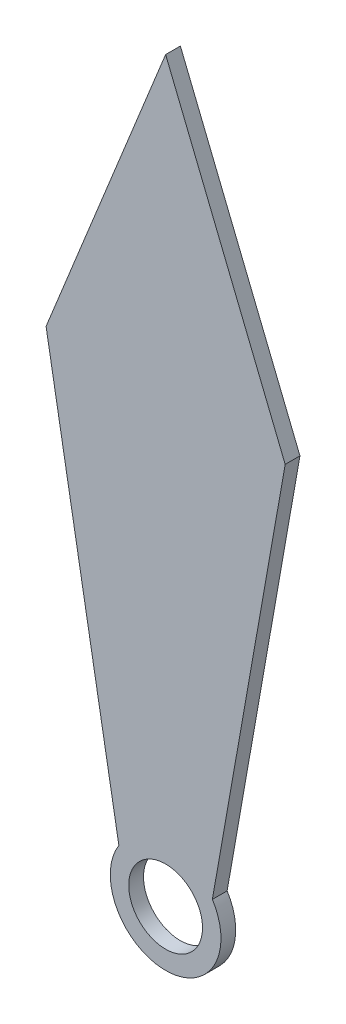
ISO-10303-21;
HEADER;
FILE_DESCRIPTION(('STEP AP214'),'2;1');
FILE_NAME('part.step','',(''),(''),'','','');
FILE_SCHEMA(('AUTOMOTIVE_DESIGN { 1 0 10303 214 1 1 1 1 }'));
ENDSEC;
DATA;
#1=APPLICATION_CONTEXT('core data for automotive mechanical design processes');
#2=APPLICATION_PROTOCOL_DEFINITION('international standard','automotive_design',2000,#1);
#3=PRODUCT_CONTEXT('',#1,'mechanical');
#4=PRODUCT('Part','Part','',(#3));
#5=PRODUCT_RELATED_PRODUCT_CATEGORY('part','',(#4));
#6=PRODUCT_DEFINITION_FORMATION('','',#4);
#7=PRODUCT_DEFINITION_CONTEXT('part definition',#1,'design');
#8=PRODUCT_DEFINITION('design','',#6,#7);
#9=PRODUCT_DEFINITION_SHAPE('','',#8);
#10=(LENGTH_UNIT() NAMED_UNIT(*) SI_UNIT(.MILLI.,.METRE.));
#11=(NAMED_UNIT(*) PLANE_ANGLE_UNIT() SI_UNIT($,.RADIAN.));
#12=(NAMED_UNIT(*) SI_UNIT($,.STERADIAN.) SOLID_ANGLE_UNIT());
#13=UNCERTAINTY_MEASURE_WITH_UNIT(LENGTH_MEASURE(1.E-05),#10,'distance_accuracy_value','');
#14=(GEOMETRIC_REPRESENTATION_CONTEXT(3) GLOBAL_UNCERTAINTY_ASSIGNED_CONTEXT((#13)) GLOBAL_UNIT_ASSIGNED_CONTEXT((#10,
#11,#12)) REPRESENTATION_CONTEXT('',''));
#15=CARTESIAN_POINT('',(0.,0.,0.));
#16=DIRECTION('',(0.,0.,1.));
#17=DIRECTION('',(1.,0.,0.));
#18=AXIS2_PLACEMENT_3D('',#15,#16,#17);
#19=CARTESIAN_POINT('',(-0.545954378426876,-0.0962028419331165,0.2));
#20=DIRECTION('',(-0.984827379924348,-0.17353683110897,0.));
#21=DIRECTION('',(0.17353683110897,-0.984827379924348,0.));
#22=AXIS2_PLACEMENT_3D('',#19,#20,#21);
#23=PLANE('',#22);
#24=DIRECTION('',(-0.17353683110897,0.984827379924349,0.));
#25=VECTOR('',#24,1.);
#26=CARTESIAN_POINT('',(-0.545954378426876,-0.0962028419331165,0.));
#27=LINE('',#26,#25);
#28=CARTESIAN_POINT('',(-0.633616904993946,0.401284958235283,0.));
#29=VERTEX_POINT('',#28);
#30=CARTESIAN_POINT('',(-1.62016874792159,6.,0.));
#31=VERTEX_POINT('',#30);
#32=EDGE_CURVE('E112',#29,#31,#27,.T.);
#33=ORIENTED_EDGE('',*,*,#32,.F.);
#34=DIRECTION('',(0.,0.,-1.));
#35=VECTOR('',#34,1.);
#36=CARTESIAN_POINT('',(-0.633616904993946,0.401284958235283,0.2));
#37=LINE('',#36,#35);
#38=CARTESIAN_POINT('',(-0.633616904993946,0.401284958235283,0.2));
#39=VERTEX_POINT('',#38);
#40=EDGE_CURVE('E11',#39,#29,#37,.T.);
#41=ORIENTED_EDGE('',*,*,#40,.F.);
#42=DIRECTION('',(-0.17353683110897,0.984827379924349,0.));
#43=VECTOR('',#42,1.);
#44=CARTESIAN_POINT('',(-0.545954378426876,-0.0962028419331165,0.2));
#45=LINE('',#44,#43);
#46=CARTESIAN_POINT('',(-1.62016874792159,6.,0.2));
#47=VERTEX_POINT('',#46);
#48=EDGE_CURVE('E125',#39,#47,#45,.T.);
#49=ORIENTED_EDGE('',*,*,#48,.T.);
#50=DIRECTION('',(0.,0.,-1.));
#51=VECTOR('',#50,1.);
#52=CARTESIAN_POINT('',(-1.62016874792159,6.,0.2));
#53=LINE('',#52,#51);
#54=EDGE_CURVE('E50',#47,#31,#53,.T.);
#55=ORIENTED_EDGE('',*,*,#54,.T.);
#56=EDGE_LOOP('',(#33,#41,#49,#55));
#57=FACE_BOUND('',#56,.T.);
#58=ADVANCED_FACE('F34',(#57),#23,.T.);
#59=CARTESIAN_POINT('',(0.,0.,0.2));
#60=DIRECTION('',(0.,0.,-1.));
#61=DIRECTION('',(-1.,0.,0.));
#62=AXIS2_PLACEMENT_3D('',#59,#60,#61);
#63=CYLINDRICAL_SURFACE('',#62,0.75);
#64=CARTESIAN_POINT('',(0.,0.,0.));
#65=DIRECTION('',(0.,0.,1.));
#66=DIRECTION('',(1.,0.,0.));
#67=AXIS2_PLACEMENT_3D('',#64,#65,#66);
#68=CIRCLE('',#67,0.75);
#69=CARTESIAN_POINT('',(0.633616904993946,0.401284958235283,0.));
#70=VERTEX_POINT('',#69);
#71=EDGE_CURVE('E114',#29,#70,#68,.T.);
#72=ORIENTED_EDGE('',*,*,#71,.T.);
#73=DIRECTION('',(0.,0.,-1.));
#74=VECTOR('',#73,1.);
#75=CARTESIAN_POINT('',(0.633616904993946,0.401284958235283,0.2));
#76=LINE('',#75,#74);
#77=CARTESIAN_POINT('',(0.633616904993946,0.401284958235283,0.2));
#78=VERTEX_POINT('',#77);
#79=EDGE_CURVE('E42',#78,#70,#76,.T.);
#80=ORIENTED_EDGE('',*,*,#79,.F.);
#81=CARTESIAN_POINT('',(0.,0.,0.2));
#82=DIRECTION('',(0.,0.,1.));
#83=DIRECTION('',(1.,0.,0.));
#84=AXIS2_PLACEMENT_3D('',#81,#82,#83);
#85=CIRCLE('',#84,0.75);
#86=EDGE_CURVE('E90',#39,#78,#85,.T.);
#87=ORIENTED_EDGE('',*,*,#86,.F.);
#88=ORIENTED_EDGE('',*,*,#40,.T.);
#89=EDGE_LOOP('',(#72,#80,#87,#88));
#90=FACE_BOUND('',#89,.T.);
#91=ADVANCED_FACE('F144',(#90),#63,.T.);
#92=CARTESIAN_POINT('',(0.545954378426876,-0.0962028419331165,0.2));
#93=DIRECTION('',(-0.984827379924348,0.17353683110897,0.));
#94=DIRECTION('',(-0.17353683110897,-0.984827379924348,0.));
#95=AXIS2_PLACEMENT_3D('',#92,#93,#94);
#96=PLANE('',#95);
#97=DIRECTION('',(0.17353683110897,0.984827379924349,0.));
#98=VECTOR('',#97,1.);
#99=CARTESIAN_POINT('',(0.545954378426876,-0.0962028419331165,0.));
#100=LINE('',#99,#98);
#101=CARTESIAN_POINT('',(1.62016874792159,6.,0.));
#102=VERTEX_POINT('',#101);
#103=EDGE_CURVE('E99',#70,#102,#100,.T.);
#104=ORIENTED_EDGE('',*,*,#103,.T.);
#105=DIRECTION('',(0.,0.,-1.));
#106=VECTOR('',#105,1.);
#107=CARTESIAN_POINT('',(1.62016874792159,6.,0.2));
#108=LINE('',#107,#106);
#109=CARTESIAN_POINT('',(1.62016874792159,6.,0.2));
#110=VERTEX_POINT('',#109);
#111=EDGE_CURVE('E96',#110,#102,#108,.T.);
#112=ORIENTED_EDGE('',*,*,#111,.F.);
#113=DIRECTION('',(0.17353683110897,0.984827379924349,0.));
#114=VECTOR('',#113,1.);
#115=CARTESIAN_POINT('',(0.545954378426876,-0.0962028419331165,0.2));
#116=LINE('',#115,#114);
#117=EDGE_CURVE('E82',#78,#110,#116,.T.);
#118=ORIENTED_EDGE('',*,*,#117,.F.);
#119=ORIENTED_EDGE('',*,*,#79,.T.);
#120=EDGE_LOOP('',(#104,#112,#118,#119));
#121=FACE_BOUND('',#120,.T.);
#122=ADVANCED_FACE('F97',(#121),#96,.F.);
#123=CARTESIAN_POINT('',(3.47956698674651,1.4093714220566,0.2));
#124=DIRECTION('',(-0.926856438610824,-0.375415958911792,0.));
#125=DIRECTION('',(0.375415958911792,-0.926856438610824,0.));
#126=AXIS2_PLACEMENT_3D('',#123,#124,#125);
#127=PLANE('',#126);
#128=DIRECTION('',(-0.375415958911792,0.926856438610824,0.));
#129=VECTOR('',#128,1.);
#130=CARTESIAN_POINT('',(3.47956698674651,1.4093714220566,0.));
#131=LINE('',#130,#129);
#132=CARTESIAN_POINT('',(0.,10.,0.));
#133=VERTEX_POINT('',#132);
#134=EDGE_CURVE('E117',#102,#133,#131,.T.);
#135=ORIENTED_EDGE('',*,*,#134,.T.);
#136=DIRECTION('',(0.,0.,-1.));
#137=VECTOR('',#136,1.);
#138=CARTESIAN_POINT('',(0.,10.,0.2));
#139=LINE('',#138,#137);
#140=CARTESIAN_POINT('',(0.,10.,0.2));
#141=VERTEX_POINT('',#140);
#142=EDGE_CURVE('E67',#141,#133,#139,.T.);
#143=ORIENTED_EDGE('',*,*,#142,.F.);
#144=DIRECTION('',(-0.375415958911792,0.926856438610824,0.));
#145=VECTOR('',#144,1.);
#146=CARTESIAN_POINT('',(3.47956698674651,1.4093714220566,0.2));
#147=LINE('',#146,#145);
#148=EDGE_CURVE('E89',#110,#141,#147,.T.);
#149=ORIENTED_EDGE('',*,*,#148,.F.);
#150=ORIENTED_EDGE('',*,*,#111,.T.);
#151=EDGE_LOOP('',(#135,#143,#149,#150));
#152=FACE_BOUND('',#151,.T.);
#153=ADVANCED_FACE('F103',(#152),#127,.F.);
#154=CARTESIAN_POINT('',(-3.47956698674651,1.4093714220566,0.2));
#155=DIRECTION('',(-0.926856438610824,0.375415958911792,0.));
#156=DIRECTION('',(-0.375415958911792,-0.926856438610824,0.));
#157=AXIS2_PLACEMENT_3D('',#154,#155,#156);
#158=PLANE('',#157);
#159=DIRECTION('',(0.375415958911792,0.926856438610824,0.));
#160=VECTOR('',#159,1.);
#161=CARTESIAN_POINT('',(-3.47956698674651,1.4093714220566,0.));
#162=LINE('',#161,#160);
#163=EDGE_CURVE('E119',#31,#133,#162,.T.);
#164=ORIENTED_EDGE('',*,*,#163,.F.);
#165=ORIENTED_EDGE('',*,*,#54,.F.);
#166=DIRECTION('',(0.375415958911792,0.926856438610824,0.));
#167=VECTOR('',#166,1.);
#168=CARTESIAN_POINT('',(-3.47956698674651,1.4093714220566,0.2));
#169=LINE('',#168,#167);
#170=EDGE_CURVE('E104',#47,#141,#169,.T.);
#171=ORIENTED_EDGE('',*,*,#170,.T.);
#172=ORIENTED_EDGE('',*,*,#142,.T.);
#173=EDGE_LOOP('',(#164,#165,#171,#172));
#174=FACE_BOUND('',#173,.T.);
#175=ADVANCED_FACE('F132',(#174),#158,.T.);
#176=CARTESIAN_POINT('',(0.,0.,0.2));
#177=DIRECTION('',(0.,0.,-1.));
#178=DIRECTION('',(-1.,0.,0.));
#179=AXIS2_PLACEMENT_3D('',#176,#177,#178);
#180=CYLINDRICAL_SURFACE('',#179,0.5);
#181=CARTESIAN_POINT('',(0.,0.,0.2));
#182=DIRECTION('',(0.,0.,1.));
#183=DIRECTION('',(1.,0.,0.));
#184=AXIS2_PLACEMENT_3D('',#181,#182,#183);
#185=CIRCLE('',#184,0.5);
#186=CARTESIAN_POINT('',(0.5,0.,0.2));
#187=VERTEX_POINT('',#186);
#188=EDGE_CURVE('E106',#187,#187,#185,.T.);
#189=ORIENTED_EDGE('',*,*,#188,.T.);
#190=EDGE_LOOP('',(#189));
#191=FACE_BOUND('',#190,.T.);
#192=CARTESIAN_POINT('',(0.,0.,0.));
#193=DIRECTION('',(0.,0.,1.));
#194=DIRECTION('',(1.,0.,0.));
#195=AXIS2_PLACEMENT_3D('',#192,#193,#194);
#196=CIRCLE('',#195,0.5);
#197=CARTESIAN_POINT('',(0.5,0.,0.));
#198=VERTEX_POINT('',#197);
#199=EDGE_CURVE('E122',#198,#198,#196,.T.);
#200=ORIENTED_EDGE('',*,*,#199,.F.);
#201=EDGE_LOOP('',(#200));
#202=FACE_BOUND('',#201,.T.);
#203=ADVANCED_FACE('F134',(#191,#202),#180,.F.);
#204=CARTESIAN_POINT('',(0.,0.,0.2));
#205=DIRECTION('',(0.,0.,1.));
#206=DIRECTION('',(1.,0.,0.));
#207=AXIS2_PLACEMENT_3D('',#204,#205,#206);
#208=PLANE('',#207);
#209=ORIENTED_EDGE('',*,*,#48,.F.);
#210=ORIENTED_EDGE('',*,*,#86,.T.);
#211=ORIENTED_EDGE('',*,*,#117,.T.);
#212=ORIENTED_EDGE('',*,*,#148,.T.);
#213=ORIENTED_EDGE('',*,*,#170,.F.);
#214=EDGE_LOOP('',(#209,#210,#211,#212,#213));
#215=FACE_BOUND('',#214,.T.);
#216=ORIENTED_EDGE('',*,*,#188,.F.);
#217=EDGE_LOOP('',(#216));
#218=FACE_BOUND('',#217,.T.);
#219=ADVANCED_FACE('F85',(#215,#218),#208,.T.);
#220=CARTESIAN_POINT('',(0.,0.,0.));
#221=DIRECTION('',(0.,0.,1.));
#222=DIRECTION('',(1.,0.,0.));
#223=AXIS2_PLACEMENT_3D('',#220,#221,#222);
#224=PLANE('',#223);
#225=ORIENTED_EDGE('',*,*,#32,.T.);
#226=ORIENTED_EDGE('',*,*,#163,.T.);
#227=ORIENTED_EDGE('',*,*,#134,.F.);
#228=ORIENTED_EDGE('',*,*,#103,.F.);
#229=ORIENTED_EDGE('',*,*,#71,.F.);
#230=EDGE_LOOP('',(#225,#226,#227,#228,#229));
#231=FACE_BOUND('',#230,.T.);
#232=ORIENTED_EDGE('',*,*,#199,.T.);
#233=EDGE_LOOP('',(#232));
#234=FACE_BOUND('',#233,.T.);
#235=ADVANCED_FACE('F130',(#231,#234),#224,.F.);
#236=CLOSED_SHELL('',(#58,#91,#122,#153,#175,#203,#219,#235));
#237=MANIFOLD_SOLID_BREP('B2',#236);
#238=ADVANCED_BREP_SHAPE_REPRESENTATION('',(#18,#237),#14);
#239=SHAPE_DEFINITION_REPRESENTATION(#9,#238);
ENDSEC;
END-ISO-10303-21;
